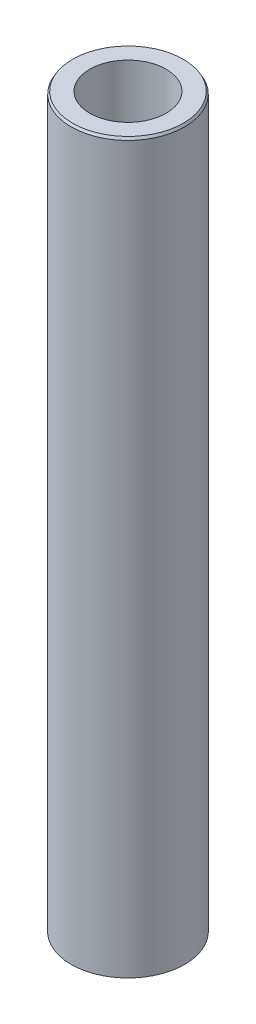
ISO-10303-21;
HEADER;
FILE_DESCRIPTION(('STEP AP214'),'2;1');
FILE_NAME('part.step','',(''),(''),'','','');
FILE_SCHEMA(('AUTOMOTIVE_DESIGN { 1 0 10303 214 1 1 1 1 }'));
ENDSEC;
DATA;
#1=APPLICATION_CONTEXT('core data for automotive mechanical design processes');
#2=APPLICATION_PROTOCOL_DEFINITION('international standard','automotive_design',2000,#1);
#3=PRODUCT_CONTEXT('',#1,'mechanical');
#4=PRODUCT('Part','Part','',(#3));
#5=PRODUCT_RELATED_PRODUCT_CATEGORY('part','',(#4));
#6=PRODUCT_DEFINITION_FORMATION('','',#4);
#7=PRODUCT_DEFINITION_CONTEXT('part definition',#1,'design');
#8=PRODUCT_DEFINITION('design','',#6,#7);
#9=PRODUCT_DEFINITION_SHAPE('','',#8);
#10=(LENGTH_UNIT() NAMED_UNIT(*) SI_UNIT(.MILLI.,.METRE.));
#11=(NAMED_UNIT(*) PLANE_ANGLE_UNIT() SI_UNIT($,.RADIAN.));
#12=(NAMED_UNIT(*) SI_UNIT($,.STERADIAN.) SOLID_ANGLE_UNIT());
#13=UNCERTAINTY_MEASURE_WITH_UNIT(LENGTH_MEASURE(1.E-05),#10,'distance_accuracy_value','');
#14=(GEOMETRIC_REPRESENTATION_CONTEXT(3) GLOBAL_UNCERTAINTY_ASSIGNED_CONTEXT((#13)) GLOBAL_UNIT_ASSIGNED_CONTEXT((#10,
#11,#12)) REPRESENTATION_CONTEXT('',''));
#15=CARTESIAN_POINT('',(0.,0.,0.));
#16=DIRECTION('',(0.,0.,1.));
#17=DIRECTION('',(1.,0.,0.));
#18=AXIS2_PLACEMENT_3D('',#15,#16,#17);
#19=CARTESIAN_POINT('',(0.,352.946405205171,0.));
#20=DIRECTION('',(0.,-1.,0.));
#21=DIRECTION('',(0.,0.,-1.));
#22=AXIS2_PLACEMENT_3D('',#19,#20,#21);
#23=CYLINDRICAL_SURFACE('',#22,27.5);
#24=CARTESIAN_POINT('',(0.,351.753972443243,0.));
#25=DIRECTION('',(0.,1.,0.));
#26=DIRECTION('',(0.,0.,1.));
#27=AXIS2_PLACEMENT_3D('',#24,#25,#26);
#28=CIRCLE('',#27,27.5);
#29=CARTESIAN_POINT('',(0.,351.753972443243,27.5));
#30=VERTEX_POINT('',#29);
#31=EDGE_CURVE('E50',#30,#30,#28,.F.);
#32=ORIENTED_EDGE('',*,*,#31,.T.);
#33=EDGE_LOOP('',(#32));
#34=FACE_BOUND('',#33,.T.);
#35=CARTESIAN_POINT('',(0.,0.68845137608986,0.));
#36=DIRECTION('',(0.,1.,0.));
#37=DIRECTION('',(0.,0.,1.));
#38=AXIS2_PLACEMENT_3D('',#35,#36,#37);
#39=CIRCLE('',#38,27.5);
#40=CARTESIAN_POINT('',(0.,0.68845137608986,27.5));
#41=VERTEX_POINT('',#40);
#42=EDGE_CURVE('E51',#41,#41,#39,.T.);
#43=ORIENTED_EDGE('',*,*,#42,.T.);
#44=EDGE_LOOP('',(#43));
#45=FACE_BOUND('',#44,.T.);
#46=ADVANCED_FACE('F39',(#34,#45),#23,.T.);
#47=CARTESIAN_POINT('',(0.,352.946405205171,0.));
#48=DIRECTION('',(0.,1.,0.));
#49=DIRECTION('',(0.,0.,1.));
#50=AXIS2_PLACEMENT_3D('',#47,#48,#49);
#51=PLANE('',#50);
#52=CARTESIAN_POINT('',(0.,352.946405205171,0.));
#53=DIRECTION('',(0.,1.,0.));
#54=DIRECTION('',(0.,0.,1.));
#55=AXIS2_PLACEMENT_3D('',#52,#53,#54);
#56=CIRCLE('',#55,26.8115486239102);
#57=CARTESIAN_POINT('',(0.,352.946405205171,26.8115486239102));
#58=VERTEX_POINT('',#57);
#59=EDGE_CURVE('E54',#58,#58,#56,.T.);
#60=ORIENTED_EDGE('',*,*,#59,.T.);
#61=EDGE_LOOP('',(#60));
#62=FACE_BOUND('',#61,.T.);
#63=CARTESIAN_POINT('',(0.,352.946405205171,0.));
#64=DIRECTION('',(0.,1.,0.));
#65=DIRECTION('',(0.,0.,1.));
#66=AXIS2_PLACEMENT_3D('',#63,#64,#65);
#67=CIRCLE('',#66,18.4862969771644);
#68=CARTESIAN_POINT('',(0.,352.946405205171,18.4862969771644));
#69=VERTEX_POINT('',#68);
#70=EDGE_CURVE('E58',#69,#69,#67,.T.);
#71=ORIENTED_EDGE('',*,*,#70,.F.);
#72=EDGE_LOOP('',(#71));
#73=FACE_BOUND('',#72,.T.);
#74=ADVANCED_FACE('F69',(#62,#73),#51,.T.);
#75=CARTESIAN_POINT('',(0.,0.,0.));
#76=DIRECTION('',(0.,1.,0.));
#77=DIRECTION('',(0.,0.,1.));
#78=AXIS2_PLACEMENT_3D('',#75,#76,#77);
#79=PLANE('',#78);
#80=CARTESIAN_POINT('',(0.,0.,0.));
#81=DIRECTION('',(0.,1.,0.));
#82=DIRECTION('',(0.,0.,1.));
#83=AXIS2_PLACEMENT_3D('',#80,#81,#82);
#84=CIRCLE('',#83,26.3075672380717);
#85=CARTESIAN_POINT('',(0.,0.,26.3075672380717));
#86=VERTEX_POINT('',#85);
#87=EDGE_CURVE('E10',#86,#86,#84,.F.);
#88=ORIENTED_EDGE('',*,*,#87,.T.);
#89=EDGE_LOOP('',(#88));
#90=FACE_BOUND('',#89,.T.);
#91=CARTESIAN_POINT('',(0.,0.,0.));
#92=DIRECTION('',(0.,1.,0.));
#93=DIRECTION('',(0.,0.,1.));
#94=AXIS2_PLACEMENT_3D('',#91,#92,#93);
#95=CIRCLE('',#94,18.4862969771644);
#96=CARTESIAN_POINT('',(0.,0.,18.4862969771644));
#97=VERTEX_POINT('',#96);
#98=EDGE_CURVE('E63',#97,#97,#95,.T.);
#99=ORIENTED_EDGE('',*,*,#98,.T.);
#100=EDGE_LOOP('',(#99));
#101=FACE_BOUND('',#100,.T.);
#102=ADVANCED_FACE('F75',(#90,#101),#79,.F.);
#103=CARTESIAN_POINT('',(0.,352.946405205171,0.));
#104=DIRECTION('',(0.,-1.,0.));
#105=DIRECTION('',(0.,0.,-1.));
#106=AXIS2_PLACEMENT_3D('',#103,#104,#105);
#107=CYLINDRICAL_SURFACE('',#106,18.4862969771644);
#108=ORIENTED_EDGE('',*,*,#70,.T.);
#109=EDGE_LOOP('',(#108));
#110=FACE_BOUND('',#109,.T.);
#111=ORIENTED_EDGE('',*,*,#98,.F.);
#112=EDGE_LOOP('',(#111));
#113=FACE_BOUND('',#112,.T.);
#114=ADVANCED_FACE('F70',(#110,#113),#107,.F.);
#115=CARTESIAN_POINT('',(0.,352.946405205171,0.));
#116=DIRECTION('',(0.,-1.,0.));
#117=DIRECTION('',(0.,0.,-1.));
#118=AXIS2_PLACEMENT_3D('',#115,#116,#117);
#119=CONICAL_SURFACE('',#118,26.8115486239102,0.523598775598296);
#120=ORIENTED_EDGE('',*,*,#31,.F.);
#121=EDGE_LOOP('',(#120));
#122=FACE_BOUND('',#121,.T.);
#123=ORIENTED_EDGE('',*,*,#59,.F.);
#124=EDGE_LOOP('',(#123));
#125=FACE_BOUND('',#124,.T.);
#126=ADVANCED_FACE('F81',(#122,#125),#119,.T.);
#127=CARTESIAN_POINT('',(0.,0.68845137608986,0.));
#128=DIRECTION('',(0.,1.,0.));
#129=DIRECTION('',(0.,0.,1.));
#130=AXIS2_PLACEMENT_3D('',#127,#128,#129);
#131=CONICAL_SURFACE('',#130,27.5,1.04719755119658);
#132=ORIENTED_EDGE('',*,*,#87,.F.);
#133=EDGE_LOOP('',(#132));
#134=FACE_BOUND('',#133,.T.);
#135=ORIENTED_EDGE('',*,*,#42,.F.);
#136=EDGE_LOOP('',(#135));
#137=FACE_BOUND('',#136,.T.);
#138=ADVANCED_FACE('F45',(#134,#137),#131,.T.);
#139=CLOSED_SHELL('',(#46,#74,#102,#114,#126,#138));
#140=MANIFOLD_SOLID_BREP('B2',#139);
#141=ADVANCED_BREP_SHAPE_REPRESENTATION('',(#18,#140),#14);
#142=SHAPE_DEFINITION_REPRESENTATION(#9,#141);
ENDSEC;
END-ISO-10303-21;
